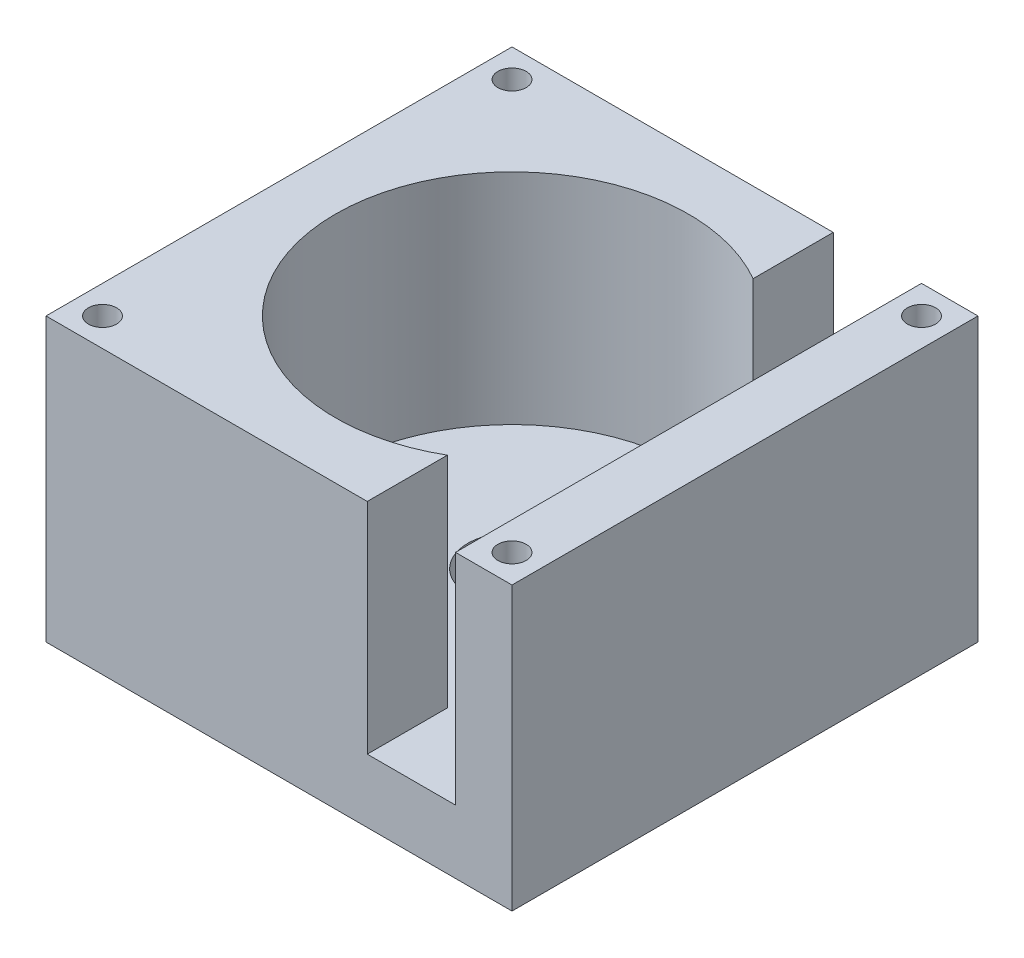
ISO-10303-21;
HEADER;
FILE_DESCRIPTION(('STEP AP214'),'2;1');
FILE_NAME('part.step','',(''),(''),'','','');
FILE_SCHEMA(('AUTOMOTIVE_DESIGN { 1 0 10303 214 1 1 1 1 }'));
ENDSEC;
DATA;
#1=APPLICATION_CONTEXT('core data for automotive mechanical design processes');
#2=APPLICATION_PROTOCOL_DEFINITION('international standard','automotive_design',2000,#1);
#3=PRODUCT_CONTEXT('',#1,'mechanical');
#4=PRODUCT('Part','Part','',(#3));
#5=PRODUCT_RELATED_PRODUCT_CATEGORY('part','',(#4));
#6=PRODUCT_DEFINITION_FORMATION('','',#4);
#7=PRODUCT_DEFINITION_CONTEXT('part definition',#1,'design');
#8=PRODUCT_DEFINITION('design','',#6,#7);
#9=PRODUCT_DEFINITION_SHAPE('','',#8);
#10=(LENGTH_UNIT() NAMED_UNIT(*) SI_UNIT(.MILLI.,.METRE.));
#11=(NAMED_UNIT(*) PLANE_ANGLE_UNIT() SI_UNIT($,.RADIAN.));
#12=(NAMED_UNIT(*) SI_UNIT($,.STERADIAN.) SOLID_ANGLE_UNIT());
#13=UNCERTAINTY_MEASURE_WITH_UNIT(LENGTH_MEASURE(1.E-05),#10,'distance_accuracy_value','');
#14=(GEOMETRIC_REPRESENTATION_CONTEXT(3) GLOBAL_UNCERTAINTY_ASSIGNED_CONTEXT((#13)) GLOBAL_UNIT_ASSIGNED_CONTEXT((#10,
#11,#12)) REPRESENTATION_CONTEXT('',''));
#15=CARTESIAN_POINT('',(0.,0.,0.));
#16=DIRECTION('',(0.,0.,1.));
#17=DIRECTION('',(1.,0.,0.));
#18=AXIS2_PLACEMENT_3D('',#15,#16,#17);
#19=CARTESIAN_POINT('',(0.,40.,0.));
#20=DIRECTION('',(0.,-1.,0.));
#21=DIRECTION('',(0.,0.,-1.));
#22=AXIS2_PLACEMENT_3D('',#19,#20,#21);
#23=PLANE('',#22);
#24=CARTESIAN_POINT('',(29.,40.,29.));
#25=DIRECTION('',(0.,1.,0.));
#26=DIRECTION('',(0.,0.,1.));
#27=AXIS2_PLACEMENT_3D('',#24,#25,#26);
#28=CIRCLE('',#27,2.);
#29=CARTESIAN_POINT('',(29.,40.,31.));
#30=VERTEX_POINT('',#29);
#31=EDGE_CURVE('E256',#30,#30,#28,.T.);
#32=ORIENTED_EDGE('',*,*,#31,.F.);
#33=EDGE_LOOP('',(#32));
#34=FACE_BOUND('',#33,.T.);
#35=CARTESIAN_POINT('',(29.,40.,-29.));
#36=DIRECTION('',(0.,1.,0.));
#37=DIRECTION('',(0.,0.,1.));
#38=AXIS2_PLACEMENT_3D('',#35,#36,#37);
#39=CIRCLE('',#38,2.);
#40=CARTESIAN_POINT('',(29.,40.,-27.));
#41=VERTEX_POINT('',#40);
#42=EDGE_CURVE('E264',#41,#41,#39,.T.);
#43=ORIENTED_EDGE('',*,*,#42,.F.);
#44=EDGE_LOOP('',(#43));
#45=FACE_BOUND('',#44,.T.);
#46=DIRECTION('',(-1.,0.,0.));
#47=VECTOR('',#46,1.);
#48=CARTESIAN_POINT('',(-33.,40.,-33.));
#49=LINE('',#48,#47);
#50=CARTESIAN_POINT('',(33.,40.,-33.));
#51=VERTEX_POINT('',#50);
#52=CARTESIAN_POINT('',(25.,40.,-33.));
#53=VERTEX_POINT('',#52);
#54=EDGE_CURVE('E93',#51,#53,#49,.T.);
#55=ORIENTED_EDGE('',*,*,#54,.T.);
#56=DIRECTION('',(0.,0.,1.));
#57=VECTOR('',#56,1.);
#58=CARTESIAN_POINT('',(25.,40.,-33.));
#59=LINE('',#58,#57);
#60=CARTESIAN_POINT('',(25.,40.,33.));
#61=VERTEX_POINT('',#60);
#62=EDGE_CURVE('E232',#53,#61,#59,.T.);
#63=ORIENTED_EDGE('',*,*,#62,.T.);
#64=DIRECTION('',(1.,0.,0.));
#65=VECTOR('',#64,1.);
#66=CARTESIAN_POINT('',(-33.,40.,33.));
#67=LINE('',#66,#65);
#68=CARTESIAN_POINT('',(33.,40.,33.));
#69=VERTEX_POINT('',#68);
#70=EDGE_CURVE('E64',#61,#69,#67,.T.);
#71=ORIENTED_EDGE('',*,*,#70,.T.);
#72=DIRECTION('',(0.,0.,-1.));
#73=VECTOR('',#72,1.);
#74=CARTESIAN_POINT('',(33.,40.,33.));
#75=LINE('',#74,#73);
#76=EDGE_CURVE('E154',#69,#51,#75,.T.);
#77=ORIENTED_EDGE('',*,*,#76,.T.);
#78=EDGE_LOOP('',(#55,#63,#71,#77));
#79=FACE_BOUND('',#78,.T.);
#80=ADVANCED_FACE('F39',(#34,#45,#79),#23,.F.);
#81=CARTESIAN_POINT('',(33.,40.,33.));
#82=DIRECTION('',(-1.,0.,0.));
#83=DIRECTION('',(0.,0.,1.));
#84=AXIS2_PLACEMENT_3D('',#81,#82,#83);
#85=PLANE('',#84);
#86=DIRECTION('',(0.,0.,-1.));
#87=VECTOR('',#86,1.);
#88=CARTESIAN_POINT('',(33.,0.,33.));
#89=LINE('',#88,#87);
#90=CARTESIAN_POINT('',(33.,0.,33.));
#91=VERTEX_POINT('',#90);
#92=CARTESIAN_POINT('',(33.,0.,-33.));
#93=VERTEX_POINT('',#92);
#94=EDGE_CURVE('E168',#91,#93,#89,.T.);
#95=ORIENTED_EDGE('',*,*,#94,.T.);
#96=DIRECTION('',(0.,-1.,0.));
#97=VECTOR('',#96,1.);
#98=CARTESIAN_POINT('',(33.,40.,-33.));
#99=LINE('',#98,#97);
#100=EDGE_CURVE('E11',#51,#93,#99,.T.);
#101=ORIENTED_EDGE('',*,*,#100,.F.);
#102=ORIENTED_EDGE('',*,*,#76,.F.);
#103=DIRECTION('',(0.,-1.,0.));
#104=VECTOR('',#103,1.);
#105=CARTESIAN_POINT('',(33.,40.,33.));
#106=LINE('',#105,#104);
#107=EDGE_CURVE('E167',#69,#91,#106,.T.);
#108=ORIENTED_EDGE('',*,*,#107,.T.);
#109=EDGE_LOOP('',(#95,#101,#102,#108));
#110=FACE_BOUND('',#109,.T.);
#111=ADVANCED_FACE('F41',(#110),#85,.F.);
#112=CARTESIAN_POINT('',(-33.,40.,-33.));
#113=DIRECTION('',(0.,0.,1.));
#114=DIRECTION('',(1.,0.,0.));
#115=AXIS2_PLACEMENT_3D('',#112,#113,#114);
#116=PLANE('',#115);
#117=DIRECTION('',(1.,0.,0.));
#118=VECTOR('',#117,1.);
#119=CARTESIAN_POINT('',(25.,9.,-33.));
#120=LINE('',#119,#118);
#121=CARTESIAN_POINT('',(12.5,9.,-33.));
#122=VERTEX_POINT('',#121);
#123=CARTESIAN_POINT('',(25.,9.,-33.));
#124=VERTEX_POINT('',#123);
#125=EDGE_CURVE('E134',#122,#124,#120,.T.);
#126=ORIENTED_EDGE('',*,*,#125,.T.);
#127=DIRECTION('',(0.,1.,0.));
#128=VECTOR('',#127,1.);
#129=CARTESIAN_POINT('',(25.,40.,-33.));
#130=LINE('',#129,#128);
#131=EDGE_CURVE('E243',#124,#53,#130,.T.);
#132=ORIENTED_EDGE('',*,*,#131,.T.);
#133=ORIENTED_EDGE('',*,*,#54,.F.);
#134=ORIENTED_EDGE('',*,*,#100,.T.);
#135=DIRECTION('',(-1.,0.,0.));
#136=VECTOR('',#135,1.);
#137=CARTESIAN_POINT('',(-33.,0.,-33.));
#138=LINE('',#137,#136);
#139=CARTESIAN_POINT('',(-33.,0.,-33.));
#140=VERTEX_POINT('',#139);
#141=EDGE_CURVE('E172',#93,#140,#138,.T.);
#142=ORIENTED_EDGE('',*,*,#141,.T.);
#143=DIRECTION('',(0.,-1.,0.));
#144=VECTOR('',#143,1.);
#145=CARTESIAN_POINT('',(-33.,40.,-33.));
#146=LINE('',#145,#144);
#147=CARTESIAN_POINT('',(-33.,40.,-33.));
#148=VERTEX_POINT('',#147);
#149=EDGE_CURVE('E48',#148,#140,#146,.T.);
#150=ORIENTED_EDGE('',*,*,#149,.F.);
#151=CARTESIAN_POINT('',(12.5,40.,-33.));
#152=VERTEX_POINT('',#151);
#153=EDGE_CURVE('E141',#152,#148,#49,.T.);
#154=ORIENTED_EDGE('',*,*,#153,.F.);
#155=DIRECTION('',(0.,-1.,0.));
#156=VECTOR('',#155,1.);
#157=CARTESIAN_POINT('',(12.5,9.,-33.));
#158=LINE('',#157,#156);
#159=EDGE_CURVE('E126',#152,#122,#158,.T.);
#160=ORIENTED_EDGE('',*,*,#159,.T.);
#161=EDGE_LOOP('',(#126,#132,#133,#134,#142,#150,#154,#160));
#162=FACE_BOUND('',#161,.T.);
#163=ADVANCED_FACE('F150',(#162),#116,.F.);
#164=CARTESIAN_POINT('',(-33.,40.,33.));
#165=DIRECTION('',(1.,0.,0.));
#166=DIRECTION('',(0.,0.,-1.));
#167=AXIS2_PLACEMENT_3D('',#164,#165,#166);
#168=PLANE('',#167);
#169=DIRECTION('',(0.,0.,1.));
#170=VECTOR('',#169,1.);
#171=CARTESIAN_POINT('',(-33.,0.,33.));
#172=LINE('',#171,#170);
#173=CARTESIAN_POINT('',(-33.,0.,33.));
#174=VERTEX_POINT('',#173);
#175=EDGE_CURVE('E176',#140,#174,#172,.T.);
#176=ORIENTED_EDGE('',*,*,#175,.T.);
#177=DIRECTION('',(0.,-1.,0.));
#178=VECTOR('',#177,1.);
#179=CARTESIAN_POINT('',(-33.,40.,33.));
#180=LINE('',#179,#178);
#181=CARTESIAN_POINT('',(-33.,40.,33.));
#182=VERTEX_POINT('',#181);
#183=EDGE_CURVE('E183',#182,#174,#180,.T.);
#184=ORIENTED_EDGE('',*,*,#183,.F.);
#185=DIRECTION('',(0.,0.,1.));
#186=VECTOR('',#185,1.);
#187=CARTESIAN_POINT('',(-33.,40.,33.));
#188=LINE('',#187,#186);
#189=EDGE_CURVE('E158',#148,#182,#188,.T.);
#190=ORIENTED_EDGE('',*,*,#189,.F.);
#191=ORIENTED_EDGE('',*,*,#149,.T.);
#192=EDGE_LOOP('',(#176,#184,#190,#191));
#193=FACE_BOUND('',#192,.T.);
#194=ADVANCED_FACE('F188',(#193),#168,.F.);
#195=CARTESIAN_POINT('',(-33.,40.,33.));
#196=DIRECTION('',(0.,0.,-1.));
#197=DIRECTION('',(-1.,0.,0.));
#198=AXIS2_PLACEMENT_3D('',#195,#196,#197);
#199=PLANE('',#198);
#200=ORIENTED_EDGE('',*,*,#70,.F.);
#201=DIRECTION('',(0.,-1.,0.));
#202=VECTOR('',#201,1.);
#203=CARTESIAN_POINT('',(25.,40.,33.));
#204=LINE('',#203,#202);
#205=CARTESIAN_POINT('',(25.,9.,33.));
#206=VERTEX_POINT('',#205);
#207=EDGE_CURVE('E199',#61,#206,#204,.T.);
#208=ORIENTED_EDGE('',*,*,#207,.T.);
#209=DIRECTION('',(-1.,0.,0.));
#210=VECTOR('',#209,1.);
#211=CARTESIAN_POINT('',(-33.,9.,33.));
#212=LINE('',#211,#210);
#213=CARTESIAN_POINT('',(12.5,9.,33.));
#214=VERTEX_POINT('',#213);
#215=EDGE_CURVE('E202',#206,#214,#212,.T.);
#216=ORIENTED_EDGE('',*,*,#215,.T.);
#217=DIRECTION('',(0.,1.,0.));
#218=VECTOR('',#217,1.);
#219=CARTESIAN_POINT('',(12.5,40.,33.));
#220=LINE('',#219,#218);
#221=CARTESIAN_POINT('',(12.5,40.,33.));
#222=VERTEX_POINT('',#221);
#223=EDGE_CURVE('E206',#214,#222,#220,.T.);
#224=ORIENTED_EDGE('',*,*,#223,.T.);
#225=EDGE_CURVE('E164',#182,#222,#67,.T.);
#226=ORIENTED_EDGE('',*,*,#225,.F.);
#227=ORIENTED_EDGE('',*,*,#183,.T.);
#228=DIRECTION('',(1.,0.,0.));
#229=VECTOR('',#228,1.);
#230=CARTESIAN_POINT('',(-33.,0.,33.));
#231=LINE('',#230,#229);
#232=EDGE_CURVE('E86',#174,#91,#231,.T.);
#233=ORIENTED_EDGE('',*,*,#232,.T.);
#234=ORIENTED_EDGE('',*,*,#107,.F.);
#235=EDGE_LOOP('',(#200,#208,#216,#224,#226,#227,#233,#234));
#236=FACE_BOUND('',#235,.T.);
#237=ADVANCED_FACE('F196',(#236),#199,.F.);
#238=CARTESIAN_POINT('',(-29.,40.,-29.));
#239=DIRECTION('',(0.,1.,0.));
#240=DIRECTION('',(0.,0.,1.));
#241=AXIS2_PLACEMENT_3D('',#238,#239,#240);
#242=CIRCLE('',#241,2.);
#243=CARTESIAN_POINT('',(-29.,40.,-27.));
#244=VERTEX_POINT('',#243);
#245=EDGE_CURVE('E272',#244,#244,#242,.T.);
#246=ORIENTED_EDGE('',*,*,#245,.F.);
#247=EDGE_LOOP('',(#246));
#248=FACE_BOUND('',#247,.T.);
#249=CARTESIAN_POINT('',(-29.,40.,29.));
#250=DIRECTION('',(0.,1.,0.));
#251=DIRECTION('',(0.,0.,1.));
#252=AXIS2_PLACEMENT_3D('',#249,#250,#251);
#253=CIRCLE('',#252,2.);
#254=CARTESIAN_POINT('',(-29.,40.,31.));
#255=VERTEX_POINT('',#254);
#256=EDGE_CURVE('E248',#255,#255,#253,.T.);
#257=ORIENTED_EDGE('',*,*,#256,.F.);
#258=EDGE_LOOP('',(#257));
#259=FACE_BOUND('',#258,.T.);
#260=ORIENTED_EDGE('',*,*,#225,.T.);
#261=DIRECTION('',(0.,0.,1.));
#262=VECTOR('',#261,1.);
#263=CARTESIAN_POINT('',(12.5,40.,-33.));
#264=LINE('',#263,#262);
#265=CARTESIAN_POINT('',(12.5,40.,21.650635094611));
#266=VERTEX_POINT('',#265);
#267=EDGE_CURVE('E148',#266,#222,#264,.T.);
#268=ORIENTED_EDGE('',*,*,#267,.F.);
#269=CARTESIAN_POINT('',(0.,40.,0.));
#270=DIRECTION('',(0.,1.,0.));
#271=DIRECTION('',(0.,0.,1.));
#272=AXIS2_PLACEMENT_3D('',#269,#270,#271);
#273=CIRCLE('',#272,25.);
#274=CARTESIAN_POINT('',(12.5,40.,-21.650635094611));
#275=VERTEX_POINT('',#274);
#276=EDGE_CURVE('E145',#275,#266,#273,.T.);
#277=ORIENTED_EDGE('',*,*,#276,.F.);
#278=EDGE_CURVE('E55',#152,#275,#264,.T.);
#279=ORIENTED_EDGE('',*,*,#278,.F.);
#280=ORIENTED_EDGE('',*,*,#153,.T.);
#281=ORIENTED_EDGE('',*,*,#189,.T.);
#282=EDGE_LOOP('',(#260,#268,#277,#279,#280,#281));
#283=FACE_BOUND('',#282,.T.);
#284=ADVANCED_FACE('F140',(#248,#259,#283),#23,.F.);
#285=CARTESIAN_POINT('',(0.,0.,0.));
#286=DIRECTION('',(0.,-1.,0.));
#287=DIRECTION('',(0.,0.,-1.));
#288=AXIS2_PLACEMENT_3D('',#285,#286,#287);
#289=PLANE('',#288);
#290=ORIENTED_EDGE('',*,*,#94,.F.);
#291=ORIENTED_EDGE('',*,*,#232,.F.);
#292=ORIENTED_EDGE('',*,*,#175,.F.);
#293=ORIENTED_EDGE('',*,*,#141,.F.);
#294=EDGE_LOOP('',(#290,#291,#292,#293));
#295=FACE_BOUND('',#294,.T.);
#296=ADVANCED_FACE('F192',(#295),#289,.T.);
#297=CARTESIAN_POINT('',(0.,9.,0.));
#298=DIRECTION('',(0.,1.,0.));
#299=DIRECTION('',(0.,0.,1.));
#300=AXIS2_PLACEMENT_3D('',#297,#298,#299);
#301=CYLINDRICAL_SURFACE('',#300,25.);
#302=ORIENTED_EDGE('',*,*,#276,.T.);
#303=DIRECTION('',(0.,1.,0.));
#304=VECTOR('',#303,1.);
#305=CARTESIAN_POINT('',(12.5,9.,21.650635094611));
#306=LINE('',#305,#304);
#307=CARTESIAN_POINT('',(12.5,9.,21.650635094611));
#308=VERTEX_POINT('',#307);
#309=EDGE_CURVE('E212',#266,#308,#306,.F.);
#310=ORIENTED_EDGE('',*,*,#309,.T.);
#311=CARTESIAN_POINT('',(0.,9.,0.));
#312=DIRECTION('',(0.,1.,0.));
#313=DIRECTION('',(0.,0.,1.));
#314=AXIS2_PLACEMENT_3D('',#311,#312,#313);
#315=CIRCLE('',#314,25.);
#316=CARTESIAN_POINT('',(12.5,9.,-21.650635094611));
#317=VERTEX_POINT('',#316);
#318=EDGE_CURVE('E173',#317,#308,#315,.T.);
#319=ORIENTED_EDGE('',*,*,#318,.F.);
#320=DIRECTION('',(0.,1.,0.));
#321=VECTOR('',#320,1.);
#322=CARTESIAN_POINT('',(12.5,9.,-21.650635094611));
#323=LINE('',#322,#321);
#324=EDGE_CURVE('E230',#317,#275,#323,.T.);
#325=ORIENTED_EDGE('',*,*,#324,.T.);
#326=EDGE_LOOP('',(#302,#310,#319,#325));
#327=FACE_BOUND('',#326,.T.);
#328=ADVANCED_FACE('F228',(#327),#301,.F.);
#329=CARTESIAN_POINT('',(0.,9.,0.));
#330=DIRECTION('',(0.,1.,0.));
#331=DIRECTION('',(0.,0.,1.));
#332=AXIS2_PLACEMENT_3D('',#329,#330,#331);
#333=PLANE('',#332);
#334=ORIENTED_EDGE('',*,*,#318,.T.);
#335=DIRECTION('',(0.,0.,1.));
#336=VECTOR('',#335,1.);
#337=CARTESIAN_POINT('',(12.5,9.,-33.));
#338=LINE('',#337,#336);
#339=EDGE_CURVE('E147',#308,#214,#338,.T.);
#340=ORIENTED_EDGE('',*,*,#339,.T.);
#341=ORIENTED_EDGE('',*,*,#215,.F.);
#342=DIRECTION('',(0.,0.,1.));
#343=VECTOR('',#342,1.);
#344=CARTESIAN_POINT('',(25.,9.,-33.));
#345=LINE('',#344,#343);
#346=EDGE_CURVE('E236',#124,#206,#345,.T.);
#347=ORIENTED_EDGE('',*,*,#346,.F.);
#348=ORIENTED_EDGE('',*,*,#125,.F.);
#349=EDGE_CURVE('E129',#122,#317,#338,.T.);
#350=ORIENTED_EDGE('',*,*,#349,.T.);
#351=EDGE_LOOP('',(#334,#340,#341,#347,#348,#350));
#352=FACE_BOUND('',#351,.T.);
#353=CARTESIAN_POINT('',(0.,9.,0.));
#354=DIRECTION('',(0.,1.,0.));
#355=DIRECTION('',(0.,0.,1.));
#356=AXIS2_PLACEMENT_3D('',#353,#354,#355);
#357=CIRCLE('',#356,6.25);
#358=CARTESIAN_POINT('',(0.,9.,6.25));
#359=VERTEX_POINT('',#358);
#360=EDGE_CURVE('E210',#359,#359,#357,.T.);
#361=ORIENTED_EDGE('',*,*,#360,.F.);
#362=EDGE_LOOP('',(#361));
#363=FACE_BOUND('',#362,.T.);
#364=ADVANCED_FACE('F352',(#352,#363),#333,.T.);
#365=CARTESIAN_POINT('',(0.,2.,0.));
#366=DIRECTION('',(0.,1.,0.));
#367=DIRECTION('',(0.,0.,1.));
#368=AXIS2_PLACEMENT_3D('',#365,#366,#367);
#369=CYLINDRICAL_SURFACE('',#368,6.25);
#370=CARTESIAN_POINT('',(0.,2.,0.));
#371=DIRECTION('',(0.,1.,0.));
#372=DIRECTION('',(0.,0.,1.));
#373=AXIS2_PLACEMENT_3D('',#370,#371,#372);
#374=CIRCLE('',#373,6.25);
#375=CARTESIAN_POINT('',(0.,2.,6.25));
#376=VERTEX_POINT('',#375);
#377=EDGE_CURVE('E216',#376,#376,#374,.T.);
#378=ORIENTED_EDGE('',*,*,#377,.F.);
#379=EDGE_LOOP('',(#378));
#380=FACE_BOUND('',#379,.T.);
#381=ORIENTED_EDGE('',*,*,#360,.T.);
#382=EDGE_LOOP('',(#381));
#383=FACE_BOUND('',#382,.T.);
#384=ADVANCED_FACE('F358',(#380,#383),#369,.F.);
#385=CARTESIAN_POINT('',(0.,2.,0.));
#386=DIRECTION('',(0.,1.,0.));
#387=DIRECTION('',(0.,0.,1.));
#388=AXIS2_PLACEMENT_3D('',#385,#386,#387);
#389=PLANE('',#388);
#390=ORIENTED_EDGE('',*,*,#377,.T.);
#391=EDGE_LOOP('',(#390));
#392=FACE_BOUND('',#391,.T.);
#393=ADVANCED_FACE('F365',(#392),#389,.T.);
#394=CARTESIAN_POINT('',(25.,40.,-33.));
#395=DIRECTION('',(1.,0.,0.));
#396=DIRECTION('',(0.,0.,-1.));
#397=AXIS2_PLACEMENT_3D('',#394,#395,#396);
#398=PLANE('',#397);
#399=ORIENTED_EDGE('',*,*,#62,.F.);
#400=ORIENTED_EDGE('',*,*,#131,.F.);
#401=ORIENTED_EDGE('',*,*,#346,.T.);
#402=ORIENTED_EDGE('',*,*,#207,.F.);
#403=EDGE_LOOP('',(#399,#400,#401,#402));
#404=FACE_BOUND('',#403,.T.);
#405=ADVANCED_FACE('F372',(#404),#398,.F.);
#406=CARTESIAN_POINT('',(12.5,9.,-33.));
#407=DIRECTION('',(-1.,0.,0.));
#408=DIRECTION('',(0.,0.,1.));
#409=AXIS2_PLACEMENT_3D('',#406,#407,#408);
#410=PLANE('',#409);
#411=ORIENTED_EDGE('',*,*,#339,.F.);
#412=ORIENTED_EDGE('',*,*,#309,.F.);
#413=ORIENTED_EDGE('',*,*,#267,.T.);
#414=ORIENTED_EDGE('',*,*,#223,.F.);
#415=EDGE_LOOP('',(#411,#412,#413,#414));
#416=FACE_BOUND('',#415,.T.);
#417=ADVANCED_FACE('F304',(#416),#410,.F.);
#418=ORIENTED_EDGE('',*,*,#349,.F.);
#419=ORIENTED_EDGE('',*,*,#159,.F.);
#420=ORIENTED_EDGE('',*,*,#278,.T.);
#421=ORIENTED_EDGE('',*,*,#324,.F.);
#422=EDGE_LOOP('',(#418,#419,#420,#421));
#423=FACE_BOUND('',#422,.T.);
#424=ADVANCED_FACE('F127',(#423),#410,.F.);
#425=CARTESIAN_POINT('',(-29.,30.,29.));
#426=DIRECTION('',(0.,1.,0.));
#427=DIRECTION('',(0.,0.,1.));
#428=AXIS2_PLACEMENT_3D('',#425,#426,#427);
#429=CYLINDRICAL_SURFACE('',#428,2.);
#430=CARTESIAN_POINT('',(-29.,30.,29.));
#431=DIRECTION('',(0.,1.,0.));
#432=DIRECTION('',(0.,0.,1.));
#433=AXIS2_PLACEMENT_3D('',#430,#431,#432);
#434=CIRCLE('',#433,2.);
#435=CARTESIAN_POINT('',(-29.,30.,31.));
#436=VERTEX_POINT('',#435);
#437=EDGE_CURVE('E135',#436,#436,#434,.T.);
#438=ORIENTED_EDGE('',*,*,#437,.F.);
#439=EDGE_LOOP('',(#438));
#440=FACE_BOUND('',#439,.T.);
#441=ORIENTED_EDGE('',*,*,#256,.T.);
#442=EDGE_LOOP('',(#441));
#443=FACE_BOUND('',#442,.T.);
#444=ADVANCED_FACE('F294',(#440,#443),#429,.F.);
#445=CARTESIAN_POINT('',(-29.,30.,29.));
#446=DIRECTION('',(0.,1.,0.));
#447=DIRECTION('',(0.,0.,1.));
#448=AXIS2_PLACEMENT_3D('',#445,#446,#447);
#449=PLANE('',#448);
#450=ORIENTED_EDGE('',*,*,#437,.T.);
#451=EDGE_LOOP('',(#450));
#452=FACE_BOUND('',#451,.T.);
#453=ADVANCED_FACE('F285',(#452),#449,.T.);
#454=CARTESIAN_POINT('',(-29.,30.,-29.));
#455=DIRECTION('',(0.,1.,0.));
#456=DIRECTION('',(0.,0.,1.));
#457=AXIS2_PLACEMENT_3D('',#454,#455,#456);
#458=CYLINDRICAL_SURFACE('',#457,2.);
#459=CARTESIAN_POINT('',(-29.,30.,-29.));
#460=DIRECTION('',(0.,1.,0.));
#461=DIRECTION('',(0.,0.,1.));
#462=AXIS2_PLACEMENT_3D('',#459,#460,#461);
#463=CIRCLE('',#462,2.);
#464=CARTESIAN_POINT('',(-29.,30.,-27.));
#465=VERTEX_POINT('',#464);
#466=EDGE_CURVE('E252',#465,#465,#463,.T.);
#467=ORIENTED_EDGE('',*,*,#466,.F.);
#468=EDGE_LOOP('',(#467));
#469=FACE_BOUND('',#468,.T.);
#470=ORIENTED_EDGE('',*,*,#245,.T.);
#471=EDGE_LOOP('',(#470));
#472=FACE_BOUND('',#471,.T.);
#473=ADVANCED_FACE('F282',(#469,#472),#458,.F.);
#474=CARTESIAN_POINT('',(-29.,30.,-29.));
#475=DIRECTION('',(0.,1.,0.));
#476=DIRECTION('',(0.,0.,1.));
#477=AXIS2_PLACEMENT_3D('',#474,#475,#476);
#478=PLANE('',#477);
#479=ORIENTED_EDGE('',*,*,#466,.T.);
#480=EDGE_LOOP('',(#479));
#481=FACE_BOUND('',#480,.T.);
#482=ADVANCED_FACE('F280',(#481),#478,.T.);
#483=CARTESIAN_POINT('',(29.,30.,-29.));
#484=DIRECTION('',(0.,1.,0.));
#485=DIRECTION('',(0.,0.,1.));
#486=AXIS2_PLACEMENT_3D('',#483,#484,#485);
#487=CYLINDRICAL_SURFACE('',#486,2.);
#488=CARTESIAN_POINT('',(29.,30.,-29.));
#489=DIRECTION('',(0.,1.,0.));
#490=DIRECTION('',(0.,0.,1.));
#491=AXIS2_PLACEMENT_3D('',#488,#489,#490);
#492=CIRCLE('',#491,2.);
#493=CARTESIAN_POINT('',(29.,30.,-27.));
#494=VERTEX_POINT('',#493);
#495=EDGE_CURVE('E268',#494,#494,#492,.T.);
#496=ORIENTED_EDGE('',*,*,#495,.F.);
#497=EDGE_LOOP('',(#496));
#498=FACE_BOUND('',#497,.T.);
#499=ORIENTED_EDGE('',*,*,#42,.T.);
#500=EDGE_LOOP('',(#499));
#501=FACE_BOUND('',#500,.T.);
#502=ADVANCED_FACE('F445',(#498,#501),#487,.F.);
#503=CARTESIAN_POINT('',(29.,30.,-29.));
#504=DIRECTION('',(0.,1.,0.));
#505=DIRECTION('',(0.,0.,1.));
#506=AXIS2_PLACEMENT_3D('',#503,#504,#505);
#507=PLANE('',#506);
#508=ORIENTED_EDGE('',*,*,#495,.T.);
#509=EDGE_LOOP('',(#508));
#510=FACE_BOUND('',#509,.T.);
#511=ADVANCED_FACE('F453',(#510),#507,.T.);
#512=CARTESIAN_POINT('',(29.,30.,29.));
#513=DIRECTION('',(0.,1.,0.));
#514=DIRECTION('',(0.,0.,1.));
#515=AXIS2_PLACEMENT_3D('',#512,#513,#514);
#516=CYLINDRICAL_SURFACE('',#515,2.);
#517=CARTESIAN_POINT('',(29.,30.,29.));
#518=DIRECTION('',(0.,1.,0.));
#519=DIRECTION('',(0.,0.,1.));
#520=AXIS2_PLACEMENT_3D('',#517,#518,#519);
#521=CIRCLE('',#520,2.);
#522=CARTESIAN_POINT('',(29.,30.,31.));
#523=VERTEX_POINT('',#522);
#524=EDGE_CURVE('E260',#523,#523,#521,.T.);
#525=ORIENTED_EDGE('',*,*,#524,.F.);
#526=EDGE_LOOP('',(#525));
#527=FACE_BOUND('',#526,.T.);
#528=ORIENTED_EDGE('',*,*,#31,.T.);
#529=EDGE_LOOP('',(#528));
#530=FACE_BOUND('',#529,.T.);
#531=ADVANCED_FACE('F462',(#527,#530),#516,.F.);
#532=CARTESIAN_POINT('',(29.,30.,29.));
#533=DIRECTION('',(0.,1.,0.));
#534=DIRECTION('',(0.,0.,1.));
#535=AXIS2_PLACEMENT_3D('',#532,#533,#534);
#536=PLANE('',#535);
#537=ORIENTED_EDGE('',*,*,#524,.T.);
#538=EDGE_LOOP('',(#537));
#539=FACE_BOUND('',#538,.T.);
#540=ADVANCED_FACE('F471',(#539),#536,.T.);
#541=CLOSED_SHELL('',(#80,#111,#163,#194,#237,#284,#296,#328,#364,#384,#393,#405,#417,#424,#444,
#453,#473,#482,#502,#511,#531,#540));
#542=MANIFOLD_SOLID_BREP('B2',#541);
#543=ADVANCED_BREP_SHAPE_REPRESENTATION('',(#18,#542),#14);
#544=SHAPE_DEFINITION_REPRESENTATION(#9,#543);
ENDSEC;
END-ISO-10303-21;
